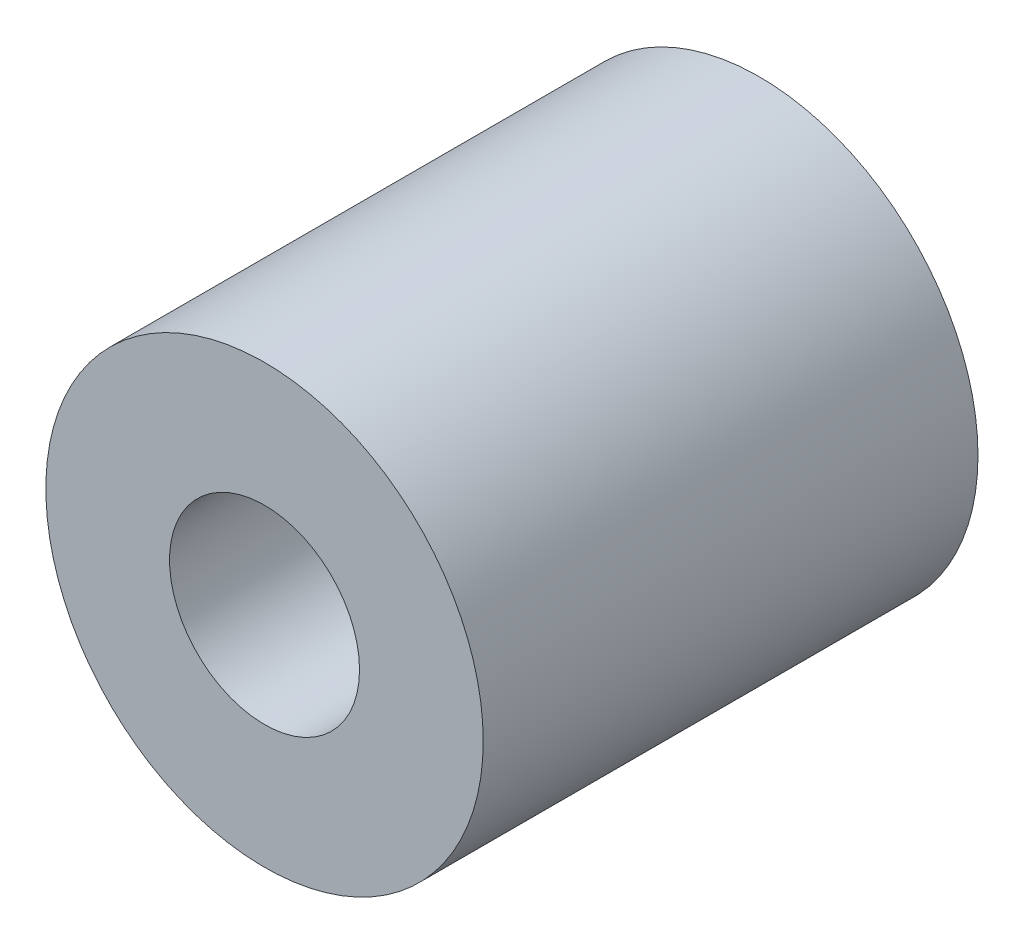
ISO-10303-21;
HEADER;
FILE_DESCRIPTION(('STEP AP214'),'2;1');
FILE_NAME('part.step','',(''),(''),'','','');
FILE_SCHEMA(('AUTOMOTIVE_DESIGN { 1 0 10303 214 1 1 1 1 }'));
ENDSEC;
DATA;
#1=APPLICATION_CONTEXT('core data for automotive mechanical design processes');
#2=APPLICATION_PROTOCOL_DEFINITION('international standard','automotive_design',2000,#1);
#3=PRODUCT_CONTEXT('',#1,'mechanical');
#4=PRODUCT('Part','Part','',(#3));
#5=PRODUCT_RELATED_PRODUCT_CATEGORY('part','',(#4));
#6=PRODUCT_DEFINITION_FORMATION('','',#4);
#7=PRODUCT_DEFINITION_CONTEXT('part definition',#1,'design');
#8=PRODUCT_DEFINITION('design','',#6,#7);
#9=PRODUCT_DEFINITION_SHAPE('','',#8);
#10=(LENGTH_UNIT() NAMED_UNIT(*) SI_UNIT(.MILLI.,.METRE.));
#11=(NAMED_UNIT(*) PLANE_ANGLE_UNIT() SI_UNIT($,.RADIAN.));
#12=(NAMED_UNIT(*) SI_UNIT($,.STERADIAN.) SOLID_ANGLE_UNIT());
#13=UNCERTAINTY_MEASURE_WITH_UNIT(LENGTH_MEASURE(1.E-05),#10,'distance_accuracy_value','');
#14=(GEOMETRIC_REPRESENTATION_CONTEXT(3) GLOBAL_UNCERTAINTY_ASSIGNED_CONTEXT((#13)) GLOBAL_UNIT_ASSIGNED_CONTEXT((#10,
#11,#12)) REPRESENTATION_CONTEXT('',''));
#15=CARTESIAN_POINT('',(0.,0.,0.));
#16=DIRECTION('',(0.,0.,1.));
#17=DIRECTION('',(1.,0.,0.));
#18=AXIS2_PLACEMENT_3D('',#15,#16,#17);
#19=CARTESIAN_POINT('',(0.,0.,12.7));
#20=DIRECTION('',(0.,0.,1.));
#21=DIRECTION('',(1.,0.,0.));
#22=AXIS2_PLACEMENT_3D('',#19,#20,#21);
#23=PLANE('',#22);
#24=CARTESIAN_POINT('',(0.,0.,12.7));
#25=DIRECTION('',(0.,0.,1.));
#26=DIRECTION('',(1.,0.,0.));
#27=AXIS2_PLACEMENT_3D('',#24,#25,#26);
#28=CIRCLE('',#27,5.6134);
#29=CARTESIAN_POINT('',(5.6134,0.,12.7));
#30=VERTEX_POINT('',#29);
#31=EDGE_CURVE('E10',#30,#30,#28,.T.);
#32=ORIENTED_EDGE('',*,*,#31,.T.);
#33=EDGE_LOOP('',(#32));
#34=FACE_BOUND('',#33,.T.);
#35=CARTESIAN_POINT('',(0.,0.,12.7));
#36=DIRECTION('',(0.,0.,1.));
#37=DIRECTION('',(1.,0.,0.));
#38=AXIS2_PLACEMENT_3D('',#35,#36,#37);
#39=CIRCLE('',#38,2.4384);
#40=CARTESIAN_POINT('',(2.4384,0.,12.7));
#41=VERTEX_POINT('',#40);
#42=EDGE_CURVE('E42',#41,#41,#39,.T.);
#43=ORIENTED_EDGE('',*,*,#42,.F.);
#44=EDGE_LOOP('',(#43));
#45=FACE_BOUND('',#44,.T.);
#46=ADVANCED_FACE('F31',(#34,#45),#23,.T.);
#47=CARTESIAN_POINT('',(0.,0.,0.));
#48=DIRECTION('',(0.,0.,1.));
#49=DIRECTION('',(1.,0.,0.));
#50=AXIS2_PLACEMENT_3D('',#47,#48,#49);
#51=PLANE('',#50);
#52=CARTESIAN_POINT('',(0.,0.,0.));
#53=DIRECTION('',(0.,0.,1.));
#54=DIRECTION('',(1.,0.,0.));
#55=AXIS2_PLACEMENT_3D('',#52,#53,#54);
#56=CIRCLE('',#55,5.6134);
#57=CARTESIAN_POINT('',(5.6134,0.,0.));
#58=VERTEX_POINT('',#57);
#59=EDGE_CURVE('E35',#58,#58,#56,.T.);
#60=ORIENTED_EDGE('',*,*,#59,.F.);
#61=EDGE_LOOP('',(#60));
#62=FACE_BOUND('',#61,.T.);
#63=CARTESIAN_POINT('',(0.,0.,0.));
#64=DIRECTION('',(0.,0.,1.));
#65=DIRECTION('',(1.,0.,0.));
#66=AXIS2_PLACEMENT_3D('',#63,#64,#65);
#67=CIRCLE('',#66,2.4384);
#68=CARTESIAN_POINT('',(2.4384,0.,0.));
#69=VERTEX_POINT('',#68);
#70=EDGE_CURVE('E44',#69,#69,#67,.T.);
#71=ORIENTED_EDGE('',*,*,#70,.T.);
#72=EDGE_LOOP('',(#71));
#73=FACE_BOUND('',#72,.T.);
#74=ADVANCED_FACE('F54',(#62,#73),#51,.F.);
#75=CARTESIAN_POINT('',(0.,0.,12.7));
#76=DIRECTION('',(0.,0.,-1.));
#77=DIRECTION('',(-1.,0.,0.));
#78=AXIS2_PLACEMENT_3D('',#75,#76,#77);
#79=CYLINDRICAL_SURFACE('',#78,5.6134);
#80=ORIENTED_EDGE('',*,*,#31,.F.);
#81=EDGE_LOOP('',(#80));
#82=FACE_BOUND('',#81,.T.);
#83=ORIENTED_EDGE('',*,*,#59,.T.);
#84=EDGE_LOOP('',(#83));
#85=FACE_BOUND('',#84,.T.);
#86=ADVANCED_FACE('F33',(#82,#85),#79,.T.);
#87=CARTESIAN_POINT('',(0.,0.,12.7));
#88=DIRECTION('',(0.,0.,-1.));
#89=DIRECTION('',(-1.,0.,0.));
#90=AXIS2_PLACEMENT_3D('',#87,#88,#89);
#91=CYLINDRICAL_SURFACE('',#90,2.4384);
#92=ORIENTED_EDGE('',*,*,#42,.T.);
#93=EDGE_LOOP('',(#92));
#94=FACE_BOUND('',#93,.T.);
#95=ORIENTED_EDGE('',*,*,#70,.F.);
#96=EDGE_LOOP('',(#95));
#97=FACE_BOUND('',#96,.T.);
#98=ADVANCED_FACE('F50',(#94,#97),#91,.F.);
#99=CLOSED_SHELL('',(#46,#74,#86,#98));
#100=MANIFOLD_SOLID_BREP('B2',#99);
#101=ADVANCED_BREP_SHAPE_REPRESENTATION('',(#18,#100),#14);
#102=SHAPE_DEFINITION_REPRESENTATION(#9,#101);
ENDSEC;
END-ISO-10303-21;
